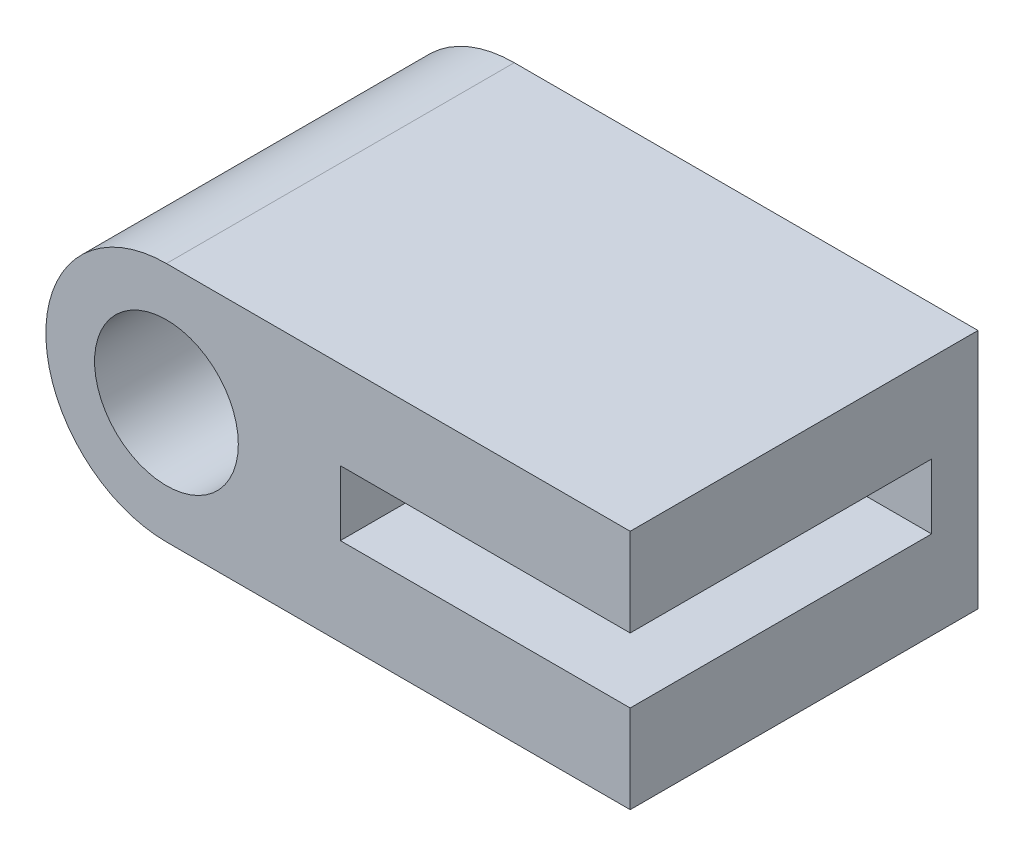
ISO-10303-21;
HEADER;
FILE_DESCRIPTION(('STEP AP214'),'2;1');
FILE_NAME('part.step','',(''),(''),'','','');
FILE_SCHEMA(('AUTOMOTIVE_DESIGN { 1 0 10303 214 1 1 1 1 }'));
ENDSEC;
DATA;
#1=APPLICATION_CONTEXT('core data for automotive mechanical design processes');
#2=APPLICATION_PROTOCOL_DEFINITION('international standard','automotive_design',2000,#1);
#3=PRODUCT_CONTEXT('',#1,'mechanical');
#4=PRODUCT('Part','Part','',(#3));
#5=PRODUCT_RELATED_PRODUCT_CATEGORY('part','',(#4));
#6=PRODUCT_DEFINITION_FORMATION('','',#4);
#7=PRODUCT_DEFINITION_CONTEXT('part definition',#1,'design');
#8=PRODUCT_DEFINITION('design','',#6,#7);
#9=PRODUCT_DEFINITION_SHAPE('','',#8);
#10=(LENGTH_UNIT() NAMED_UNIT(*) SI_UNIT(.MILLI.,.METRE.));
#11=(NAMED_UNIT(*) PLANE_ANGLE_UNIT() SI_UNIT($,.RADIAN.));
#12=(NAMED_UNIT(*) SI_UNIT($,.STERADIAN.) SOLID_ANGLE_UNIT());
#13=UNCERTAINTY_MEASURE_WITH_UNIT(LENGTH_MEASURE(1.E-05),#10,'distance_accuracy_value','');
#14=(GEOMETRIC_REPRESENTATION_CONTEXT(3) GLOBAL_UNCERTAINTY_ASSIGNED_CONTEXT((#13)) GLOBAL_UNIT_ASSIGNED_CONTEXT((#10,
#11,#12)) REPRESENTATION_CONTEXT('',''));
#15=CARTESIAN_POINT('',(0.,0.,0.));
#16=DIRECTION('',(0.,0.,1.));
#17=DIRECTION('',(1.,0.,0.));
#18=AXIS2_PLACEMENT_3D('',#15,#16,#17);
#19=CARTESIAN_POINT('',(0.,0.,15.));
#20=DIRECTION('',(0.,0.,1.));
#21=DIRECTION('',(1.,0.,0.));
#22=AXIS2_PLACEMENT_3D('',#19,#20,#21);
#23=PLANE('',#22);
#24=DIRECTION('',(1.,0.,0.));
#25=VECTOR('',#24,1.);
#26=CARTESIAN_POINT('',(20.,-1.4,15.));
#27=LINE('',#26,#25);
#28=CARTESIAN_POINT('',(7.5,-1.4,15.));
#29=VERTEX_POINT('',#28);
#30=CARTESIAN_POINT('',(20.,-1.4,15.));
#31=VERTEX_POINT('',#30);
#32=EDGE_CURVE('E123',#29,#31,#27,.T.);
#33=ORIENTED_EDGE('',*,*,#32,.F.);
#34=DIRECTION('',(0.,-1.,0.));
#35=VECTOR('',#34,1.);
#36=CARTESIAN_POINT('',(7.5,-1.4,15.));
#37=LINE('',#36,#35);
#38=CARTESIAN_POINT('',(7.5,1.4,15.));
#39=VERTEX_POINT('',#38);
#40=EDGE_CURVE('E130',#39,#29,#37,.T.);
#41=ORIENTED_EDGE('',*,*,#40,.F.);
#42=DIRECTION('',(-1.,0.,0.));
#43=VECTOR('',#42,1.);
#44=CARTESIAN_POINT('',(20.,1.4,15.));
#45=LINE('',#44,#43);
#46=CARTESIAN_POINT('',(20.,1.4,15.));
#47=VERTEX_POINT('',#46);
#48=EDGE_CURVE('E114',#47,#39,#45,.T.);
#49=ORIENTED_EDGE('',*,*,#48,.F.);
#50=DIRECTION('',(0.,1.,0.));
#51=VECTOR('',#50,1.);
#52=CARTESIAN_POINT('',(20.,5.2,15.));
#53=LINE('',#52,#51);
#54=CARTESIAN_POINT('',(20.,5.2,15.));
#55=VERTEX_POINT('',#54);
#56=EDGE_CURVE('E127',#47,#55,#53,.T.);
#57=ORIENTED_EDGE('',*,*,#56,.T.);
#58=DIRECTION('',(-1.,0.,0.));
#59=VECTOR('',#58,1.);
#60=CARTESIAN_POINT('',(0.,5.2,15.));
#61=LINE('',#60,#59);
#62=CARTESIAN_POINT('',(0.,5.2,15.));
#63=VERTEX_POINT('',#62);
#64=EDGE_CURVE('E60',#55,#63,#61,.T.);
#65=ORIENTED_EDGE('',*,*,#64,.T.);
#66=CARTESIAN_POINT('',(0.,0.,15.));
#67=DIRECTION('',(0.,0.,1.));
#68=DIRECTION('',(1.,0.,0.));
#69=AXIS2_PLACEMENT_3D('',#66,#67,#68);
#70=CIRCLE('',#69,5.2);
#71=CARTESIAN_POINT('',(0.,-5.2,15.));
#72=VERTEX_POINT('',#71);
#73=EDGE_CURVE('E137',#63,#72,#70,.T.);
#74=ORIENTED_EDGE('',*,*,#73,.T.);
#75=DIRECTION('',(1.,0.,0.));
#76=VECTOR('',#75,1.);
#77=CARTESIAN_POINT('',(20.,-5.2,15.));
#78=LINE('',#77,#76);
#79=CARTESIAN_POINT('',(20.,-5.2,15.));
#80=VERTEX_POINT('',#79);
#81=EDGE_CURVE('E88',#72,#80,#78,.T.);
#82=ORIENTED_EDGE('',*,*,#81,.T.);
#83=EDGE_CURVE('E134',#80,#31,#53,.T.);
#84=ORIENTED_EDGE('',*,*,#83,.T.);
#85=EDGE_LOOP('',(#33,#41,#49,#57,#65,#74,#82,#84));
#86=FACE_BOUND('',#85,.T.);
#87=CARTESIAN_POINT('',(0.,0.,15.));
#88=DIRECTION('',(0.,0.,1.));
#89=DIRECTION('',(1.,0.,0.));
#90=AXIS2_PLACEMENT_3D('',#87,#88,#89);
#91=CIRCLE('',#90,3.1);
#92=CARTESIAN_POINT('',(3.1,0.,15.));
#93=VERTEX_POINT('',#92);
#94=EDGE_CURVE('E147',#93,#93,#91,.T.);
#95=ORIENTED_EDGE('',*,*,#94,.F.);
#96=EDGE_LOOP('',(#95));
#97=FACE_BOUND('',#96,.T.);
#98=ADVANCED_FACE('F36',(#86,#97),#23,.T.);
#99=CARTESIAN_POINT('',(0.,0.,0.));
#100=DIRECTION('',(0.,0.,1.));
#101=DIRECTION('',(1.,0.,0.));
#102=AXIS2_PLACEMENT_3D('',#99,#100,#101);
#103=PLANE('',#102);
#104=CARTESIAN_POINT('',(0.,0.,0.));
#105=DIRECTION('',(0.,0.,1.));
#106=DIRECTION('',(1.,0.,0.));
#107=AXIS2_PLACEMENT_3D('',#104,#105,#106);
#108=CIRCLE('',#107,5.2);
#109=CARTESIAN_POINT('',(0.,5.2,0.));
#110=VERTEX_POINT('',#109);
#111=CARTESIAN_POINT('',(0.,-5.2,0.));
#112=VERTEX_POINT('',#111);
#113=EDGE_CURVE('E143',#110,#112,#108,.T.);
#114=ORIENTED_EDGE('',*,*,#113,.F.);
#115=DIRECTION('',(-1.,0.,0.));
#116=VECTOR('',#115,1.);
#117=CARTESIAN_POINT('',(0.,5.2,0.));
#118=LINE('',#117,#116);
#119=CARTESIAN_POINT('',(20.,5.2,0.));
#120=VERTEX_POINT('',#119);
#121=EDGE_CURVE('E81',#120,#110,#118,.T.);
#122=ORIENTED_EDGE('',*,*,#121,.F.);
#123=DIRECTION('',(0.,1.,0.));
#124=VECTOR('',#123,1.);
#125=CARTESIAN_POINT('',(20.,5.2,0.));
#126=LINE('',#125,#124);
#127=CARTESIAN_POINT('',(20.,-5.2,0.));
#128=VERTEX_POINT('',#127);
#129=EDGE_CURVE('E149',#128,#120,#126,.T.);
#130=ORIENTED_EDGE('',*,*,#129,.F.);
#131=DIRECTION('',(1.,0.,0.));
#132=VECTOR('',#131,1.);
#133=CARTESIAN_POINT('',(20.,-5.2,0.));
#134=LINE('',#133,#132);
#135=EDGE_CURVE('E146',#112,#128,#134,.T.);
#136=ORIENTED_EDGE('',*,*,#135,.F.);
#137=EDGE_LOOP('',(#114,#122,#130,#136));
#138=FACE_BOUND('',#137,.T.);
#139=CARTESIAN_POINT('',(0.,0.,0.));
#140=DIRECTION('',(0.,0.,1.));
#141=DIRECTION('',(1.,0.,0.));
#142=AXIS2_PLACEMENT_3D('',#139,#140,#141);
#143=CIRCLE('',#142,3.1);
#144=CARTESIAN_POINT('',(3.1,0.,0.));
#145=VERTEX_POINT('',#144);
#146=EDGE_CURVE('E200',#145,#145,#143,.T.);
#147=ORIENTED_EDGE('',*,*,#146,.T.);
#148=EDGE_LOOP('',(#147));
#149=FACE_BOUND('',#148,.T.);
#150=ADVANCED_FACE('F158',(#138,#149),#103,.F.);
#151=CARTESIAN_POINT('',(0.,0.,15.));
#152=DIRECTION('',(0.,0.,-1.));
#153=DIRECTION('',(-1.,0.,0.));
#154=AXIS2_PLACEMENT_3D('',#151,#152,#153);
#155=CYLINDRICAL_SURFACE('',#154,5.2);
#156=ORIENTED_EDGE('',*,*,#113,.T.);
#157=DIRECTION('',(0.,0.,-1.));
#158=VECTOR('',#157,1.);
#159=CARTESIAN_POINT('',(0.,-5.2,15.));
#160=LINE('',#159,#158);
#161=EDGE_CURVE('E12',#72,#112,#160,.T.);
#162=ORIENTED_EDGE('',*,*,#161,.F.);
#163=ORIENTED_EDGE('',*,*,#73,.F.);
#164=DIRECTION('',(0.,0.,-1.));
#165=VECTOR('',#164,1.);
#166=CARTESIAN_POINT('',(0.,5.2,15.));
#167=LINE('',#166,#165);
#168=EDGE_CURVE('E142',#63,#110,#167,.T.);
#169=ORIENTED_EDGE('',*,*,#168,.T.);
#170=EDGE_LOOP('',(#156,#162,#163,#169));
#171=FACE_BOUND('',#170,.T.);
#172=ADVANCED_FACE('F38',(#171),#155,.T.);
#173=CARTESIAN_POINT('',(20.,-5.2,15.));
#174=DIRECTION('',(0.,1.,0.));
#175=DIRECTION('',(-1.,0.,0.));
#176=AXIS2_PLACEMENT_3D('',#173,#174,#175);
#177=PLANE('',#176);
#178=ORIENTED_EDGE('',*,*,#135,.T.);
#179=DIRECTION('',(0.,0.,-1.));
#180=VECTOR('',#179,1.);
#181=CARTESIAN_POINT('',(20.,-5.2,15.));
#182=LINE('',#181,#180);
#183=EDGE_CURVE('E44',#80,#128,#182,.T.);
#184=ORIENTED_EDGE('',*,*,#183,.F.);
#185=ORIENTED_EDGE('',*,*,#81,.F.);
#186=ORIENTED_EDGE('',*,*,#161,.T.);
#187=EDGE_LOOP('',(#178,#184,#185,#186));
#188=FACE_BOUND('',#187,.T.);
#189=ADVANCED_FACE('F174',(#188),#177,.F.);
#190=CARTESIAN_POINT('',(20.,5.2,15.));
#191=DIRECTION('',(-1.,0.,0.));
#192=DIRECTION('',(0.,0.,1.));
#193=AXIS2_PLACEMENT_3D('',#190,#191,#192);
#194=PLANE('',#193);
#195=DIRECTION('',(0.,-1.,0.));
#196=VECTOR('',#195,1.);
#197=CARTESIAN_POINT('',(20.,-1.4,2.));
#198=LINE('',#197,#196);
#199=CARTESIAN_POINT('',(20.,1.4,2.));
#200=VERTEX_POINT('',#199);
#201=CARTESIAN_POINT('',(20.,-1.4,2.));
#202=VERTEX_POINT('',#201);
#203=EDGE_CURVE('E196',#200,#202,#198,.T.);
#204=ORIENTED_EDGE('',*,*,#203,.T.);
#205=DIRECTION('',(0.,0.,1.));
#206=VECTOR('',#205,1.);
#207=CARTESIAN_POINT('',(20.,-1.4,-12.8097619025492));
#208=LINE('',#207,#206);
#209=EDGE_CURVE('E51',#202,#31,#208,.T.);
#210=ORIENTED_EDGE('',*,*,#209,.T.);
#211=ORIENTED_EDGE('',*,*,#83,.F.);
#212=ORIENTED_EDGE('',*,*,#183,.T.);
#213=ORIENTED_EDGE('',*,*,#129,.T.);
#214=DIRECTION('',(0.,0.,-1.));
#215=VECTOR('',#214,1.);
#216=CARTESIAN_POINT('',(20.,5.2,15.));
#217=LINE('',#216,#215);
#218=EDGE_CURVE('E133',#55,#120,#217,.T.);
#219=ORIENTED_EDGE('',*,*,#218,.F.);
#220=ORIENTED_EDGE('',*,*,#56,.F.);
#221=DIRECTION('',(0.,0.,1.));
#222=VECTOR('',#221,1.);
#223=CARTESIAN_POINT('',(20.,1.4,-12.8097619025492));
#224=LINE('',#223,#222);
#225=EDGE_CURVE('E110',#200,#47,#224,.T.);
#226=ORIENTED_EDGE('',*,*,#225,.F.);
#227=EDGE_LOOP('',(#204,#210,#211,#212,#213,#219,#220,#226));
#228=FACE_BOUND('',#227,.T.);
#229=ADVANCED_FACE('F132',(#228),#194,.F.);
#230=CARTESIAN_POINT('',(0.,5.2,15.));
#231=DIRECTION('',(0.,-1.,0.));
#232=DIRECTION('',(1.,0.,0.));
#233=AXIS2_PLACEMENT_3D('',#230,#231,#232);
#234=PLANE('',#233);
#235=ORIENTED_EDGE('',*,*,#121,.T.);
#236=ORIENTED_EDGE('',*,*,#168,.F.);
#237=ORIENTED_EDGE('',*,*,#64,.F.);
#238=ORIENTED_EDGE('',*,*,#218,.T.);
#239=EDGE_LOOP('',(#235,#236,#237,#238));
#240=FACE_BOUND('',#239,.T.);
#241=ADVANCED_FACE('F163',(#240),#234,.F.);
#242=CARTESIAN_POINT('',(0.,0.,15.));
#243=DIRECTION('',(0.,0.,-1.));
#244=DIRECTION('',(-1.,0.,0.));
#245=AXIS2_PLACEMENT_3D('',#242,#243,#244);
#246=CYLINDRICAL_SURFACE('',#245,3.1);
#247=ORIENTED_EDGE('',*,*,#94,.T.);
#248=EDGE_LOOP('',(#247));
#249=FACE_BOUND('',#248,.T.);
#250=ORIENTED_EDGE('',*,*,#146,.F.);
#251=EDGE_LOOP('',(#250));
#252=FACE_BOUND('',#251,.T.);
#253=ADVANCED_FACE('F165',(#249,#252),#246,.F.);
#254=CARTESIAN_POINT('',(20.,-1.4,-12.8097619025492));
#255=DIRECTION('',(0.,-1.,0.));
#256=DIRECTION('',(1.,0.,0.));
#257=AXIS2_PLACEMENT_3D('',#254,#255,#256);
#258=PLANE('',#257);
#259=DIRECTION('',(-1.,0.,0.));
#260=VECTOR('',#259,1.);
#261=CARTESIAN_POINT('',(20.,-1.4,2.));
#262=LINE('',#261,#260);
#263=CARTESIAN_POINT('',(7.5,-1.4,2.));
#264=VERTEX_POINT('',#263);
#265=EDGE_CURVE('E198',#202,#264,#262,.T.);
#266=ORIENTED_EDGE('',*,*,#265,.T.);
#267=DIRECTION('',(0.,0.,1.));
#268=VECTOR('',#267,1.);
#269=CARTESIAN_POINT('',(7.5,-1.4,-12.8097619025492));
#270=LINE('',#269,#268);
#271=EDGE_CURVE('E209',#264,#29,#270,.T.);
#272=ORIENTED_EDGE('',*,*,#271,.T.);
#273=ORIENTED_EDGE('',*,*,#32,.T.);
#274=ORIENTED_EDGE('',*,*,#209,.F.);
#275=EDGE_LOOP('',(#266,#272,#273,#274));
#276=FACE_BOUND('',#275,.T.);
#277=ADVANCED_FACE('F171',(#276),#258,.F.);
#278=CARTESIAN_POINT('',(7.5,-1.4,-12.8097619025492));
#279=DIRECTION('',(-1.,0.,0.));
#280=DIRECTION('',(0.,-1.,0.));
#281=AXIS2_PLACEMENT_3D('',#278,#279,#280);
#282=PLANE('',#281);
#283=DIRECTION('',(0.,1.,0.));
#284=VECTOR('',#283,1.);
#285=CARTESIAN_POINT('',(7.5,-1.4,2.));
#286=LINE('',#285,#284);
#287=CARTESIAN_POINT('',(7.5,1.4,2.));
#288=VERTEX_POINT('',#287);
#289=EDGE_CURVE('E202',#264,#288,#286,.T.);
#290=ORIENTED_EDGE('',*,*,#289,.T.);
#291=DIRECTION('',(0.,0.,1.));
#292=VECTOR('',#291,1.);
#293=CARTESIAN_POINT('',(7.5,1.4,-12.8097619025492));
#294=LINE('',#293,#292);
#295=EDGE_CURVE('E122',#288,#39,#294,.T.);
#296=ORIENTED_EDGE('',*,*,#295,.T.);
#297=ORIENTED_EDGE('',*,*,#40,.T.);
#298=ORIENTED_EDGE('',*,*,#271,.F.);
#299=EDGE_LOOP('',(#290,#296,#297,#298));
#300=FACE_BOUND('',#299,.T.);
#301=ADVANCED_FACE('F186',(#300),#282,.F.);
#302=CARTESIAN_POINT('',(20.,1.4,-12.8097619025492));
#303=DIRECTION('',(0.,1.,0.));
#304=DIRECTION('',(-1.,0.,0.));
#305=AXIS2_PLACEMENT_3D('',#302,#303,#304);
#306=PLANE('',#305);
#307=DIRECTION('',(1.,0.,0.));
#308=VECTOR('',#307,1.);
#309=CARTESIAN_POINT('',(20.,1.4,2.));
#310=LINE('',#309,#308);
#311=EDGE_CURVE('E117',#288,#200,#310,.T.);
#312=ORIENTED_EDGE('',*,*,#311,.T.);
#313=ORIENTED_EDGE('',*,*,#225,.T.);
#314=ORIENTED_EDGE('',*,*,#48,.T.);
#315=ORIENTED_EDGE('',*,*,#295,.F.);
#316=EDGE_LOOP('',(#312,#313,#314,#315));
#317=FACE_BOUND('',#316,.T.);
#318=ADVANCED_FACE('F112',(#317),#306,.F.);
#319=CARTESIAN_POINT('',(0.,0.,2.));
#320=DIRECTION('',(0.,0.,1.));
#321=DIRECTION('',(1.,0.,0.));
#322=AXIS2_PLACEMENT_3D('',#319,#320,#321);
#323=PLANE('',#322);
#324=ORIENTED_EDGE('',*,*,#203,.F.);
#325=ORIENTED_EDGE('',*,*,#311,.F.);
#326=ORIENTED_EDGE('',*,*,#289,.F.);
#327=ORIENTED_EDGE('',*,*,#265,.F.);
#328=EDGE_LOOP('',(#324,#325,#326,#327));
#329=FACE_BOUND('',#328,.T.);
#330=ADVANCED_FACE('F185',(#329),#323,.T.);
#331=CLOSED_SHELL('',(#98,#150,#172,#189,#229,#241,#253,#277,#301,#318,#330));
#332=MANIFOLD_SOLID_BREP('B2',#331);
#333=ADVANCED_BREP_SHAPE_REPRESENTATION('',(#18,#332),#14);
#334=SHAPE_DEFINITION_REPRESENTATION(#9,#333);
ENDSEC;
END-ISO-10303-21;
